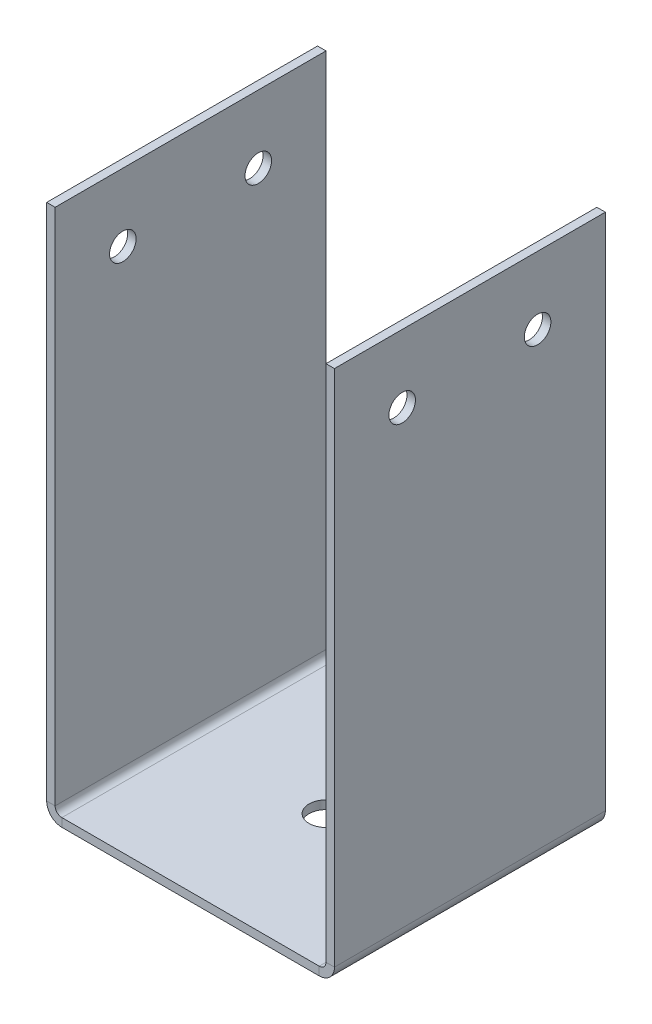
ISO-10303-21;
HEADER;
FILE_DESCRIPTION(('STEP AP214'),'2;1');
FILE_NAME('part.step','',(''),(''),'','','');
FILE_SCHEMA(('AUTOMOTIVE_DESIGN { 1 0 10303 214 1 1 1 1 }'));
ENDSEC;
DATA;
#1=APPLICATION_CONTEXT('core data for automotive mechanical design processes');
#2=APPLICATION_PROTOCOL_DEFINITION('international standard','automotive_design',2000,#1);
#3=PRODUCT_CONTEXT('',#1,'mechanical');
#4=PRODUCT('Part','Part','',(#3));
#5=PRODUCT_RELATED_PRODUCT_CATEGORY('part','',(#4));
#6=PRODUCT_DEFINITION_FORMATION('','',#4);
#7=PRODUCT_DEFINITION_CONTEXT('part definition',#1,'design');
#8=PRODUCT_DEFINITION('design','',#6,#7);
#9=PRODUCT_DEFINITION_SHAPE('','',#8);
#10=(LENGTH_UNIT() NAMED_UNIT(*) SI_UNIT(.MILLI.,.METRE.));
#11=(NAMED_UNIT(*) PLANE_ANGLE_UNIT() SI_UNIT($,.RADIAN.));
#12=(NAMED_UNIT(*) SI_UNIT($,.STERADIAN.) SOLID_ANGLE_UNIT());
#13=UNCERTAINTY_MEASURE_WITH_UNIT(LENGTH_MEASURE(1.E-05),#10,'distance_accuracy_value','');
#14=(GEOMETRIC_REPRESENTATION_CONTEXT(3) GLOBAL_UNCERTAINTY_ASSIGNED_CONTEXT((#13)) GLOBAL_UNIT_ASSIGNED_CONTEXT((#10,
#11,#12)) REPRESENTATION_CONTEXT('',''));
#15=CARTESIAN_POINT('',(0.,0.,0.));
#16=DIRECTION('',(0.,0.,1.));
#17=DIRECTION('',(1.,0.,0.));
#18=AXIS2_PLACEMENT_3D('',#15,#16,#17);
#19=CARTESIAN_POINT('',(0.,-1.5875,50.8));
#20=DIRECTION('',(0.,1.,0.));
#21=DIRECTION('',(0.,0.,1.));
#22=AXIS2_PLACEMENT_3D('',#19,#20,#21);
#23=PLANE('',#22);
#24=CARTESIAN_POINT('',(25.4,-1.58750000000001,25.4));
#25=DIRECTION('',(0.,1.,0.));
#26=DIRECTION('',(0.,0.,1.));
#27=AXIS2_PLACEMENT_3D('',#24,#25,#26);
#28=CIRCLE('',#27,3.175);
#29=CARTESIAN_POINT('',(25.4,-1.58750000000001,28.575));
#30=VERTEX_POINT('',#29);
#31=EDGE_CURVE('E366',#30,#30,#28,.T.);
#32=ORIENTED_EDGE('',*,*,#31,.T.);
#33=EDGE_LOOP('',(#32));
#34=FACE_BOUND('',#33,.T.);
#35=DIRECTION('',(0.,0.,-1.));
#36=VECTOR('',#35,1.);
#37=CARTESIAN_POINT('',(49.53,-1.5875,0.));
#38=LINE('',#37,#36);
#39=CARTESIAN_POINT('',(49.53,-1.5875,0.));
#40=VERTEX_POINT('',#39);
#41=CARTESIAN_POINT('',(49.53,-1.5875,50.8));
#42=VERTEX_POINT('',#41);
#43=EDGE_CURVE('E141',#40,#42,#38,.F.);
#44=ORIENTED_EDGE('',*,*,#43,.T.);
#45=DIRECTION('',(1.,0.,0.));
#46=VECTOR('',#45,1.);
#47=CARTESIAN_POINT('',(0.,-1.5875,50.8));
#48=LINE('',#47,#46);
#49=CARTESIAN_POINT('',(1.27,-1.5875,50.8));
#50=VERTEX_POINT('',#49);
#51=EDGE_CURVE('E51',#50,#42,#48,.T.);
#52=ORIENTED_EDGE('',*,*,#51,.F.);
#53=DIRECTION('',(0.,0.,1.));
#54=VECTOR('',#53,1.);
#55=CARTESIAN_POINT('',(1.27,-1.5875,50.8));
#56=LINE('',#55,#54);
#57=CARTESIAN_POINT('',(1.27,-1.5875,0.));
#58=VERTEX_POINT('',#57);
#59=EDGE_CURVE('E262',#50,#58,#56,.F.);
#60=ORIENTED_EDGE('',*,*,#59,.T.);
#61=DIRECTION('',(1.,0.,0.));
#62=VECTOR('',#61,1.);
#63=CARTESIAN_POINT('',(0.,-1.5875,0.));
#64=LINE('',#63,#62);
#65=EDGE_CURVE('E286',#58,#40,#64,.T.);
#66=ORIENTED_EDGE('',*,*,#65,.T.);
#67=EDGE_LOOP('',(#44,#52,#60,#66));
#68=FACE_BOUND('',#67,.T.);
#69=ADVANCED_FACE('F42',(#34,#68),#23,.F.);
#70=CARTESIAN_POINT('',(0.,0.,50.8));
#71=DIRECTION('',(0.,1.,0.));
#72=DIRECTION('',(0.,0.,1.));
#73=AXIS2_PLACEMENT_3D('',#70,#71,#72);
#74=PLANE('',#73);
#75=CARTESIAN_POINT('',(25.4,0.,25.4));
#76=DIRECTION('',(0.,1.,0.));
#77=DIRECTION('',(0.,0.,1.));
#78=AXIS2_PLACEMENT_3D('',#75,#76,#77);
#79=CIRCLE('',#78,3.175);
#80=CARTESIAN_POINT('',(25.4,0.,28.575));
#81=VERTEX_POINT('',#80);
#82=EDGE_CURVE('E45',#81,#81,#79,.T.);
#83=ORIENTED_EDGE('',*,*,#82,.F.);
#84=EDGE_LOOP('',(#83));
#85=FACE_BOUND('',#84,.T.);
#86=DIRECTION('',(1.,0.,0.));
#87=VECTOR('',#86,1.);
#88=CARTESIAN_POINT('',(0.,0.,50.8));
#89=LINE('',#88,#87);
#90=CARTESIAN_POINT('',(1.27,0.,50.8));
#91=VERTEX_POINT('',#90);
#92=CARTESIAN_POINT('',(49.53,0.,50.8));
#93=VERTEX_POINT('',#92);
#94=EDGE_CURVE('E11',#91,#93,#89,.T.);
#95=ORIENTED_EDGE('',*,*,#94,.T.);
#96=DIRECTION('',(0.,0.,-1.));
#97=VECTOR('',#96,1.);
#98=CARTESIAN_POINT('',(49.53,0.,0.));
#99=LINE('',#98,#97);
#100=CARTESIAN_POINT('',(49.53,0.,0.));
#101=VERTEX_POINT('',#100);
#102=EDGE_CURVE('E206',#101,#93,#99,.F.);
#103=ORIENTED_EDGE('',*,*,#102,.F.);
#104=DIRECTION('',(1.,0.,0.));
#105=VECTOR('',#104,1.);
#106=CARTESIAN_POINT('',(0.,0.,0.));
#107=LINE('',#106,#105);
#108=CARTESIAN_POINT('',(1.27,0.,0.));
#109=VERTEX_POINT('',#108);
#110=EDGE_CURVE('E292',#109,#101,#107,.T.);
#111=ORIENTED_EDGE('',*,*,#110,.F.);
#112=DIRECTION('',(0.,0.,1.));
#113=VECTOR('',#112,1.);
#114=CARTESIAN_POINT('',(1.27,0.,50.8));
#115=LINE('',#114,#113);
#116=EDGE_CURVE('E58',#91,#109,#115,.F.);
#117=ORIENTED_EDGE('',*,*,#116,.F.);
#118=EDGE_LOOP('',(#95,#103,#111,#117));
#119=FACE_BOUND('',#118,.T.);
#120=ADVANCED_FACE('F356',(#85,#119),#74,.T.);
#121=CARTESIAN_POINT('',(0.,0.,50.8));
#122=DIRECTION('',(0.,0.,-1.));
#123=DIRECTION('',(-1.,0.,0.));
#124=AXIS2_PLACEMENT_3D('',#121,#122,#123);
#125=PLANE('',#124);
#126=DIRECTION('',(0.,-1.,0.));
#127=VECTOR('',#126,1.);
#128=CARTESIAN_POINT('',(49.53,0.,50.8));
#129=LINE('',#128,#127);
#130=EDGE_CURVE('E212',#93,#42,#129,.T.);
#131=ORIENTED_EDGE('',*,*,#130,.F.);
#132=ORIENTED_EDGE('',*,*,#94,.F.);
#133=DIRECTION('',(0.,-1.,0.));
#134=VECTOR('',#133,1.);
#135=CARTESIAN_POINT('',(1.27,0.,50.8));
#136=LINE('',#135,#134);
#137=EDGE_CURVE('E271',#91,#50,#136,.T.);
#138=ORIENTED_EDGE('',*,*,#137,.T.);
#139=ORIENTED_EDGE('',*,*,#51,.T.);
#140=EDGE_LOOP('',(#131,#132,#138,#139));
#141=FACE_BOUND('',#140,.T.);
#142=ADVANCED_FACE('F361',(#141),#125,.F.);
#143=CARTESIAN_POINT('',(0.,0.,0.));
#144=DIRECTION('',(0.,0.,-1.));
#145=DIRECTION('',(-1.,0.,0.));
#146=AXIS2_PLACEMENT_3D('',#143,#144,#145);
#147=PLANE('',#146);
#148=ORIENTED_EDGE('',*,*,#110,.T.);
#149=DIRECTION('',(0.,-1.,0.));
#150=VECTOR('',#149,1.);
#151=CARTESIAN_POINT('',(49.53,0.,0.));
#152=LINE('',#151,#150);
#153=EDGE_CURVE('E201',#101,#40,#152,.T.);
#154=ORIENTED_EDGE('',*,*,#153,.T.);
#155=ORIENTED_EDGE('',*,*,#65,.F.);
#156=DIRECTION('',(0.,-1.,0.));
#157=VECTOR('',#156,1.);
#158=CARTESIAN_POINT('',(1.27,0.,0.));
#159=LINE('',#158,#157);
#160=EDGE_CURVE('E66',#109,#58,#159,.T.);
#161=ORIENTED_EDGE('',*,*,#160,.F.);
#162=EDGE_LOOP('',(#148,#154,#155,#161));
#163=FACE_BOUND('',#162,.T.);
#164=ADVANCED_FACE('F426',(#163),#147,.T.);
#165=CARTESIAN_POINT('',(1.27,1.27,0.));
#166=DIRECTION('',(0.,0.,-1.));
#167=DIRECTION('',(-1.,0.,0.));
#168=AXIS2_PLACEMENT_3D('',#165,#166,#167);
#169=PLANE('',#168);
#170=DIRECTION('',(-1.,0.,0.));
#171=VECTOR('',#170,1.);
#172=CARTESIAN_POINT('',(0.,1.27,0.));
#173=LINE('',#172,#171);
#174=CARTESIAN_POINT('',(0.,1.27,0.));
#175=VERTEX_POINT('',#174);
#176=CARTESIAN_POINT('',(-1.5875,1.26999999999999,0.));
#177=VERTEX_POINT('',#176);
#178=EDGE_CURVE('E216',#175,#177,#173,.T.);
#179=ORIENTED_EDGE('',*,*,#178,.F.);
#180=CARTESIAN_POINT('',(1.27,1.27,0.));
#181=DIRECTION('',(0.,0.,1.));
#182=DIRECTION('',(1.,0.,0.));
#183=AXIS2_PLACEMENT_3D('',#180,#181,#182);
#184=CIRCLE('',#183,1.27);
#185=EDGE_CURVE('E275',#109,#175,#184,.F.);
#186=ORIENTED_EDGE('',*,*,#185,.F.);
#187=ORIENTED_EDGE('',*,*,#160,.T.);
#188=CARTESIAN_POINT('',(1.27,1.27,0.));
#189=DIRECTION('',(0.,0.,1.));
#190=DIRECTION('',(1.,0.,0.));
#191=AXIS2_PLACEMENT_3D('',#188,#189,#190);
#192=CIRCLE('',#191,2.8575);
#193=EDGE_CURVE('E266',#58,#177,#192,.F.);
#194=ORIENTED_EDGE('',*,*,#193,.T.);
#195=EDGE_LOOP('',(#179,#186,#187,#194));
#196=FACE_BOUND('',#195,.T.);
#197=ADVANCED_FACE('F396',(#196),#169,.T.);
#198=CARTESIAN_POINT('',(1.27,1.27,50.8));
#199=DIRECTION('',(0.,0.,-1.));
#200=DIRECTION('',(-1.,0.,0.));
#201=AXIS2_PLACEMENT_3D('',#198,#199,#200);
#202=PLANE('',#201);
#203=CARTESIAN_POINT('',(1.27,1.27,50.8));
#204=DIRECTION('',(0.,0.,1.));
#205=DIRECTION('',(1.,0.,0.));
#206=AXIS2_PLACEMENT_3D('',#203,#204,#205);
#207=CIRCLE('',#206,1.27);
#208=CARTESIAN_POINT('',(0.,1.27,50.8));
#209=VERTEX_POINT('',#208);
#210=EDGE_CURVE('E261',#209,#91,#207,.T.);
#211=ORIENTED_EDGE('',*,*,#210,.F.);
#212=DIRECTION('',(-1.,0.,0.));
#213=VECTOR('',#212,1.);
#214=CARTESIAN_POINT('',(0.,1.27,50.8));
#215=LINE('',#214,#213);
#216=CARTESIAN_POINT('',(-1.5875,1.26999999999999,50.8));
#217=VERTEX_POINT('',#216);
#218=EDGE_CURVE('E223',#209,#217,#215,.T.);
#219=ORIENTED_EDGE('',*,*,#218,.T.);
#220=CARTESIAN_POINT('',(1.27,1.27,50.8));
#221=DIRECTION('',(0.,0.,1.));
#222=DIRECTION('',(1.,0.,0.));
#223=AXIS2_PLACEMENT_3D('',#220,#221,#222);
#224=CIRCLE('',#223,2.8575);
#225=EDGE_CURVE('E267',#217,#50,#224,.T.);
#226=ORIENTED_EDGE('',*,*,#225,.T.);
#227=ORIENTED_EDGE('',*,*,#137,.F.);
#228=EDGE_LOOP('',(#211,#219,#226,#227));
#229=FACE_BOUND('',#228,.T.);
#230=ADVANCED_FACE('F375',(#229),#202,.F.);
#231=CARTESIAN_POINT('',(1.27,1.27,50.8));
#232=DIRECTION('',(0.,0.,1.));
#233=DIRECTION('',(-1.,0.,0.));
#234=AXIS2_PLACEMENT_3D('',#231,#232,#233);
#235=CYLINDRICAL_SURFACE('',#234,2.8575);
#236=ORIENTED_EDGE('',*,*,#59,.F.);
#237=ORIENTED_EDGE('',*,*,#225,.F.);
#238=DIRECTION('',(0.,0.,-1.));
#239=VECTOR('',#238,1.);
#240=CARTESIAN_POINT('',(-1.5875,1.26999999999999,0.));
#241=LINE('',#240,#239);
#242=EDGE_CURVE('E227',#217,#177,#241,.T.);
#243=ORIENTED_EDGE('',*,*,#242,.T.);
#244=ORIENTED_EDGE('',*,*,#193,.F.);
#245=EDGE_LOOP('',(#236,#237,#243,#244));
#246=FACE_BOUND('',#245,.T.);
#247=ADVANCED_FACE('F374',(#246),#235,.T.);
#248=CARTESIAN_POINT('',(1.27,1.27,50.8));
#249=DIRECTION('',(0.,0.,1.));
#250=DIRECTION('',(-1.,0.,0.));
#251=AXIS2_PLACEMENT_3D('',#248,#249,#250);
#252=CYLINDRICAL_SURFACE('',#251,1.27);
#253=ORIENTED_EDGE('',*,*,#116,.T.);
#254=ORIENTED_EDGE('',*,*,#185,.T.);
#255=DIRECTION('',(0.,0.,1.));
#256=VECTOR('',#255,1.);
#257=CARTESIAN_POINT('',(0.,1.27,0.));
#258=LINE('',#257,#256);
#259=EDGE_CURVE('E220',#175,#209,#258,.T.);
#260=ORIENTED_EDGE('',*,*,#259,.T.);
#261=ORIENTED_EDGE('',*,*,#210,.T.);
#262=EDGE_LOOP('',(#253,#254,#260,#261));
#263=FACE_BOUND('',#262,.T.);
#264=ADVANCED_FACE('F399',(#263),#252,.F.);
#265=CARTESIAN_POINT('',(-1.58750000000034,98.4885,50.8));
#266=DIRECTION('',(0.,0.,-1.));
#267=DIRECTION('',(-1.,0.,0.));
#268=AXIS2_PLACEMENT_3D('',#265,#266,#267);
#269=PLANE('',#268);
#270=ORIENTED_EDGE('',*,*,#218,.F.);
#271=DIRECTION('',(0.,1.,0.));
#272=VECTOR('',#271,1.);
#273=CARTESIAN_POINT('',(-3.43870759840652E-13,98.4885,50.8));
#274=LINE('',#273,#272);
#275=CARTESIAN_POINT('',(-3.43870759840652E-13,98.4885,50.8));
#276=VERTEX_POINT('',#275);
#277=EDGE_CURVE('E233',#209,#276,#274,.T.);
#278=ORIENTED_EDGE('',*,*,#277,.T.);
#279=DIRECTION('',(1.,0.,0.));
#280=VECTOR('',#279,1.);
#281=CARTESIAN_POINT('',(-1.58750000000034,98.4885,50.8));
#282=LINE('',#281,#280);
#283=CARTESIAN_POINT('',(-1.58750000000034,98.4885,50.8));
#284=VERTEX_POINT('',#283);
#285=EDGE_CURVE('E257',#284,#276,#282,.T.);
#286=ORIENTED_EDGE('',*,*,#285,.F.);
#287=DIRECTION('',(0.,1.,0.));
#288=VECTOR('',#287,1.);
#289=CARTESIAN_POINT('',(-1.58750000000034,98.4885,50.8));
#290=LINE('',#289,#288);
#291=EDGE_CURVE('E234',#217,#284,#290,.T.);
#292=ORIENTED_EDGE('',*,*,#291,.F.);
#293=EDGE_LOOP('',(#270,#278,#286,#292));
#294=FACE_BOUND('',#293,.T.);
#295=ADVANCED_FACE('F385',(#294),#269,.F.);
#296=CARTESIAN_POINT('',(-1.5875,0.,0.));
#297=DIRECTION('',(0.,0.,1.));
#298=DIRECTION('',(1.,0.,0.));
#299=AXIS2_PLACEMENT_3D('',#296,#297,#298);
#300=PLANE('',#299);
#301=ORIENTED_EDGE('',*,*,#178,.T.);
#302=DIRECTION('',(0.,-1.,0.));
#303=VECTOR('',#302,1.);
#304=CARTESIAN_POINT('',(-1.5875,0.,0.));
#305=LINE('',#304,#303);
#306=CARTESIAN_POINT('',(-1.58750000000034,98.4885,0.));
#307=VERTEX_POINT('',#306);
#308=EDGE_CURVE('E241',#307,#177,#305,.T.);
#309=ORIENTED_EDGE('',*,*,#308,.F.);
#310=DIRECTION('',(1.,0.,0.));
#311=VECTOR('',#310,1.);
#312=CARTESIAN_POINT('',(-1.58750000000034,98.4885,0.));
#313=LINE('',#312,#311);
#314=CARTESIAN_POINT('',(-3.43870759840652E-13,98.4885,0.));
#315=VERTEX_POINT('',#314);
#316=EDGE_CURVE('E245',#307,#315,#313,.T.);
#317=ORIENTED_EDGE('',*,*,#316,.T.);
#318=DIRECTION('',(0.,-1.,0.));
#319=VECTOR('',#318,1.);
#320=CARTESIAN_POINT('',(0.,0.,0.));
#321=LINE('',#320,#319);
#322=EDGE_CURVE('E238',#315,#175,#321,.T.);
#323=ORIENTED_EDGE('',*,*,#322,.T.);
#324=EDGE_LOOP('',(#301,#309,#317,#323));
#325=FACE_BOUND('',#324,.T.);
#326=ADVANCED_FACE('F393',(#325),#300,.F.);
#327=CARTESIAN_POINT('',(-1.5875,0.,0.));
#328=DIRECTION('',(1.,0.,0.));
#329=DIRECTION('',(0.,1.,0.));
#330=AXIS2_PLACEMENT_3D('',#327,#328,#329);
#331=PLANE('',#330);
#332=CARTESIAN_POINT('',(-1.58750000000039,85.7885,38.1));
#333=DIRECTION('',(1.,0.,0.));
#334=DIRECTION('',(0.,1.,0.));
#335=AXIS2_PLACEMENT_3D('',#332,#333,#334);
#336=CIRCLE('',#335,2.4892);
#337=CARTESIAN_POINT('',(-1.58750000000038,88.2777,38.1));
#338=VERTEX_POINT('',#337);
#339=EDGE_CURVE('E302',#338,#338,#336,.T.);
#340=ORIENTED_EDGE('',*,*,#339,.T.);
#341=EDGE_LOOP('',(#340));
#342=FACE_BOUND('',#341,.T.);
#343=CARTESIAN_POINT('',(-1.58750000000039,85.7885,12.7));
#344=DIRECTION('',(1.,0.,0.));
#345=DIRECTION('',(0.,1.,0.));
#346=AXIS2_PLACEMENT_3D('',#343,#344,#345);
#347=CIRCLE('',#346,2.4892);
#348=CARTESIAN_POINT('',(-1.58750000000038,88.2777,12.7));
#349=VERTEX_POINT('',#348);
#350=EDGE_CURVE('E672',#349,#349,#347,.T.);
#351=ORIENTED_EDGE('',*,*,#350,.T.);
#352=EDGE_LOOP('',(#351));
#353=FACE_BOUND('',#352,.T.);
#354=ORIENTED_EDGE('',*,*,#242,.F.);
#355=ORIENTED_EDGE('',*,*,#291,.T.);
#356=DIRECTION('',(0.,0.,-1.));
#357=VECTOR('',#356,1.);
#358=CARTESIAN_POINT('',(-1.58750000000034,98.4885,0.));
#359=LINE('',#358,#357);
#360=EDGE_CURVE('E237',#284,#307,#359,.T.);
#361=ORIENTED_EDGE('',*,*,#360,.T.);
#362=ORIENTED_EDGE('',*,*,#308,.T.);
#363=EDGE_LOOP('',(#354,#355,#361,#362));
#364=FACE_BOUND('',#363,.T.);
#365=ADVANCED_FACE('F382',(#342,#353,#364),#331,.F.);
#366=CARTESIAN_POINT('',(0.,0.,0.));
#367=DIRECTION('',(1.,0.,0.));
#368=DIRECTION('',(0.,1.,0.));
#369=AXIS2_PLACEMENT_3D('',#366,#367,#368);
#370=PLANE('',#369);
#371=CARTESIAN_POINT('',(-2.99456640040496E-13,85.7885,38.1));
#372=DIRECTION('',(1.,0.,0.));
#373=DIRECTION('',(0.,1.,0.));
#374=AXIS2_PLACEMENT_3D('',#371,#372,#373);
#375=CIRCLE('',#374,2.4892);
#376=CARTESIAN_POINT('',(-3.08147635389145E-13,88.2777,38.1));
#377=VERTEX_POINT('',#376);
#378=EDGE_CURVE('E306',#377,#377,#375,.T.);
#379=ORIENTED_EDGE('',*,*,#378,.F.);
#380=EDGE_LOOP('',(#379));
#381=FACE_BOUND('',#380,.T.);
#382=CARTESIAN_POINT('',(-2.99456640040496E-13,85.7885,12.7));
#383=DIRECTION('',(1.,0.,0.));
#384=DIRECTION('',(0.,1.,0.));
#385=AXIS2_PLACEMENT_3D('',#382,#383,#384);
#386=CIRCLE('',#385,2.4892);
#387=CARTESIAN_POINT('',(-3.08147635389145E-13,88.2777,12.7));
#388=VERTEX_POINT('',#387);
#389=EDGE_CURVE('E301',#388,#388,#386,.T.);
#390=ORIENTED_EDGE('',*,*,#389,.F.);
#391=EDGE_LOOP('',(#390));
#392=FACE_BOUND('',#391,.T.);
#393=ORIENTED_EDGE('',*,*,#277,.F.);
#394=ORIENTED_EDGE('',*,*,#259,.F.);
#395=ORIENTED_EDGE('',*,*,#322,.F.);
#396=DIRECTION('',(0.,0.,-1.));
#397=VECTOR('',#396,1.);
#398=CARTESIAN_POINT('',(-3.43870759840652E-13,98.4885,0.));
#399=LINE('',#398,#397);
#400=EDGE_CURVE('E248',#276,#315,#399,.T.);
#401=ORIENTED_EDGE('',*,*,#400,.F.);
#402=EDGE_LOOP('',(#393,#394,#395,#401));
#403=FACE_BOUND('',#402,.T.);
#404=ADVANCED_FACE('F401',(#381,#392,#403),#370,.T.);
#405=CARTESIAN_POINT('',(-1.58750000000034,98.4885,0.));
#406=DIRECTION('',(0.,-1.,0.));
#407=DIRECTION('',(1.,0.,0.));
#408=AXIS2_PLACEMENT_3D('',#405,#406,#407);
#409=PLANE('',#408);
#410=ORIENTED_EDGE('',*,*,#400,.T.);
#411=ORIENTED_EDGE('',*,*,#316,.F.);
#412=ORIENTED_EDGE('',*,*,#360,.F.);
#413=ORIENTED_EDGE('',*,*,#285,.T.);
#414=EDGE_LOOP('',(#410,#411,#412,#413));
#415=FACE_BOUND('',#414,.T.);
#416=ADVANCED_FACE('F390',(#415),#409,.F.);
#417=CARTESIAN_POINT('',(49.53,1.27,50.8));
#418=DIRECTION('',(0.,0.,1.));
#419=DIRECTION('',(1.,0.,0.));
#420=AXIS2_PLACEMENT_3D('',#417,#418,#419);
#421=PLANE('',#420);
#422=DIRECTION('',(1.,0.,0.));
#423=VECTOR('',#422,1.);
#424=CARTESIAN_POINT('',(50.8,1.26999999999999,50.8));
#425=LINE('',#424,#423);
#426=CARTESIAN_POINT('',(50.8,1.26999999999999,50.8));
#427=VERTEX_POINT('',#426);
#428=CARTESIAN_POINT('',(52.3875,1.26999999999999,50.8));
#429=VERTEX_POINT('',#428);
#430=EDGE_CURVE('E312',#427,#429,#425,.T.);
#431=ORIENTED_EDGE('',*,*,#430,.F.);
#432=CARTESIAN_POINT('',(49.53,1.27,50.8));
#433=DIRECTION('',(0.,0.,-1.));
#434=DIRECTION('',(-1.,0.,0.));
#435=AXIS2_PLACEMENT_3D('',#432,#433,#434);
#436=CIRCLE('',#435,1.27);
#437=EDGE_CURVE('E145',#93,#427,#436,.F.);
#438=ORIENTED_EDGE('',*,*,#437,.F.);
#439=ORIENTED_EDGE('',*,*,#130,.T.);
#440=CARTESIAN_POINT('',(49.53,1.27,50.8));
#441=DIRECTION('',(0.,0.,-1.));
#442=DIRECTION('',(-1.,0.,0.));
#443=AXIS2_PLACEMENT_3D('',#440,#441,#442);
#444=CIRCLE('',#443,2.8575);
#445=EDGE_CURVE('E199',#42,#429,#444,.F.);
#446=ORIENTED_EDGE('',*,*,#445,.T.);
#447=EDGE_LOOP('',(#431,#438,#439,#446));
#448=FACE_BOUND('',#447,.T.);
#449=ADVANCED_FACE('F330',(#448),#421,.T.);
#450=CARTESIAN_POINT('',(49.53,1.27,0.));
#451=DIRECTION('',(0.,0.,1.));
#452=DIRECTION('',(1.,0.,0.));
#453=AXIS2_PLACEMENT_3D('',#450,#451,#452);
#454=PLANE('',#453);
#455=CARTESIAN_POINT('',(49.53,1.27,0.));
#456=DIRECTION('',(0.,0.,-1.));
#457=DIRECTION('',(-1.,0.,0.));
#458=AXIS2_PLACEMENT_3D('',#455,#456,#457);
#459=CIRCLE('',#458,1.27);
#460=CARTESIAN_POINT('',(50.8,1.26999999999999,0.));
#461=VERTEX_POINT('',#460);
#462=EDGE_CURVE('E152',#461,#101,#459,.T.);
#463=ORIENTED_EDGE('',*,*,#462,.F.);
#464=DIRECTION('',(1.,0.,0.));
#465=VECTOR('',#464,1.);
#466=CARTESIAN_POINT('',(50.8,1.26999999999999,0.));
#467=LINE('',#466,#465);
#468=CARTESIAN_POINT('',(52.3875,1.26999999999999,0.));
#469=VERTEX_POINT('',#468);
#470=EDGE_CURVE('E149',#461,#469,#467,.T.);
#471=ORIENTED_EDGE('',*,*,#470,.T.);
#472=CARTESIAN_POINT('',(49.53,1.27,0.));
#473=DIRECTION('',(0.,0.,-1.));
#474=DIRECTION('',(-1.,0.,0.));
#475=AXIS2_PLACEMENT_3D('',#472,#473,#474);
#476=CIRCLE('',#475,2.8575);
#477=EDGE_CURVE('E134',#469,#40,#476,.T.);
#478=ORIENTED_EDGE('',*,*,#477,.T.);
#479=ORIENTED_EDGE('',*,*,#153,.F.);
#480=EDGE_LOOP('',(#463,#471,#478,#479));
#481=FACE_BOUND('',#480,.T.);
#482=ADVANCED_FACE('F150',(#481),#454,.F.);
#483=CARTESIAN_POINT('',(49.53,1.27,0.));
#484=DIRECTION('',(0.,0.,-1.));
#485=DIRECTION('',(1.,0.,0.));
#486=AXIS2_PLACEMENT_3D('',#483,#484,#485);
#487=CYLINDRICAL_SURFACE('',#486,2.8575);
#488=ORIENTED_EDGE('',*,*,#43,.F.);
#489=ORIENTED_EDGE('',*,*,#477,.F.);
#490=DIRECTION('',(0.,0.,1.));
#491=VECTOR('',#490,1.);
#492=CARTESIAN_POINT('',(52.3875,1.26999999999999,0.));
#493=LINE('',#492,#491);
#494=EDGE_CURVE('E139',#469,#429,#493,.T.);
#495=ORIENTED_EDGE('',*,*,#494,.T.);
#496=ORIENTED_EDGE('',*,*,#445,.F.);
#497=EDGE_LOOP('',(#488,#489,#495,#496));
#498=FACE_BOUND('',#497,.T.);
#499=ADVANCED_FACE('F136',(#498),#487,.T.);
#500=CARTESIAN_POINT('',(49.53,1.27,0.));
#501=DIRECTION('',(0.,0.,-1.));
#502=DIRECTION('',(1.,0.,0.));
#503=AXIS2_PLACEMENT_3D('',#500,#501,#502);
#504=CYLINDRICAL_SURFACE('',#503,1.27);
#505=ORIENTED_EDGE('',*,*,#102,.T.);
#506=ORIENTED_EDGE('',*,*,#437,.T.);
#507=DIRECTION('',(0.,0.,-1.));
#508=VECTOR('',#507,1.);
#509=CARTESIAN_POINT('',(50.8,1.26999999999999,50.8));
#510=LINE('',#509,#508);
#511=EDGE_CURVE('E157',#427,#461,#510,.T.);
#512=ORIENTED_EDGE('',*,*,#511,.T.);
#513=ORIENTED_EDGE('',*,*,#462,.T.);
#514=EDGE_LOOP('',(#505,#506,#512,#513));
#515=FACE_BOUND('',#514,.T.);
#516=ADVANCED_FACE('F333',(#515),#504,.F.);
#517=CARTESIAN_POINT('',(52.3875000000003,98.4884999999998,0.));
#518=DIRECTION('',(0.,0.,1.));
#519=DIRECTION('',(1.,0.,0.));
#520=AXIS2_PLACEMENT_3D('',#517,#518,#519);
#521=PLANE('',#520);
#522=ORIENTED_EDGE('',*,*,#470,.F.);
#523=DIRECTION('',(0.,1.,0.));
#524=VECTOR('',#523,1.);
#525=CARTESIAN_POINT('',(50.8000000000003,98.4884999999998,0.));
#526=LINE('',#525,#524);
#527=CARTESIAN_POINT('',(50.8000000000003,98.4884999999998,0.));
#528=VERTEX_POINT('',#527);
#529=EDGE_CURVE('E167',#461,#528,#526,.T.);
#530=ORIENTED_EDGE('',*,*,#529,.T.);
#531=DIRECTION('',(-1.,0.,0.));
#532=VECTOR('',#531,1.);
#533=CARTESIAN_POINT('',(52.3875000000003,98.4884999999998,0.));
#534=LINE('',#533,#532);
#535=CARTESIAN_POINT('',(52.3875000000003,98.4884999999998,0.));
#536=VERTEX_POINT('',#535);
#537=EDGE_CURVE('E171',#536,#528,#534,.T.);
#538=ORIENTED_EDGE('',*,*,#537,.F.);
#539=DIRECTION('',(0.,1.,0.));
#540=VECTOR('',#539,1.);
#541=CARTESIAN_POINT('',(52.3875000000003,98.4884999999998,0.));
#542=LINE('',#541,#540);
#543=EDGE_CURVE('E162',#469,#536,#542,.T.);
#544=ORIENTED_EDGE('',*,*,#543,.F.);
#545=EDGE_LOOP('',(#522,#530,#538,#544));
#546=FACE_BOUND('',#545,.T.);
#547=ADVANCED_FACE('F169',(#546),#521,.F.);
#548=CARTESIAN_POINT('',(52.3875,0.,50.8));
#549=DIRECTION('',(0.,0.,-1.));
#550=DIRECTION('',(-1.,0.,0.));
#551=AXIS2_PLACEMENT_3D('',#548,#549,#550);
#552=PLANE('',#551);
#553=ORIENTED_EDGE('',*,*,#430,.T.);
#554=DIRECTION('',(0.,-1.,0.));
#555=VECTOR('',#554,1.);
#556=CARTESIAN_POINT('',(52.3875,0.,50.8));
#557=LINE('',#556,#555);
#558=CARTESIAN_POINT('',(52.3875000000003,98.4884999999998,50.8));
#559=VERTEX_POINT('',#558);
#560=EDGE_CURVE('E165',#559,#429,#557,.T.);
#561=ORIENTED_EDGE('',*,*,#560,.F.);
#562=DIRECTION('',(-1.,0.,0.));
#563=VECTOR('',#562,1.);
#564=CARTESIAN_POINT('',(52.3875000000003,98.4884999999998,50.8));
#565=LINE('',#564,#563);
#566=CARTESIAN_POINT('',(50.8000000000003,98.4884999999998,50.8));
#567=VERTEX_POINT('',#566);
#568=EDGE_CURVE('E187',#559,#567,#565,.T.);
#569=ORIENTED_EDGE('',*,*,#568,.T.);
#570=DIRECTION('',(0.,-1.,0.));
#571=VECTOR('',#570,1.);
#572=CARTESIAN_POINT('',(50.8,0.,50.8));
#573=LINE('',#572,#571);
#574=EDGE_CURVE('E175',#567,#427,#573,.T.);
#575=ORIENTED_EDGE('',*,*,#574,.T.);
#576=EDGE_LOOP('',(#553,#561,#569,#575));
#577=FACE_BOUND('',#576,.T.);
#578=ADVANCED_FACE('F326',(#577),#552,.F.);
#579=CARTESIAN_POINT('',(52.3875,-1.84495502999552E-13,0.));
#580=DIRECTION('',(-1.,0.,0.));
#581=DIRECTION('',(0.,-1.,0.));
#582=AXIS2_PLACEMENT_3D('',#579,#580,#581);
#583=PLANE('',#582);
#584=CARTESIAN_POINT('',(52.3875000000003,85.7884999999998,38.1));
#585=DIRECTION('',(1.,0.,0.));
#586=DIRECTION('',(0.,1.,0.));
#587=AXIS2_PLACEMENT_3D('',#584,#585,#586);
#588=CIRCLE('',#587,2.4892);
#589=CARTESIAN_POINT('',(52.3875000000003,88.2776999999998,38.1));
#590=VERTEX_POINT('',#589);
#591=EDGE_CURVE('E677',#590,#590,#588,.T.);
#592=ORIENTED_EDGE('',*,*,#591,.F.);
#593=EDGE_LOOP('',(#592));
#594=FACE_BOUND('',#593,.T.);
#595=CARTESIAN_POINT('',(52.3875000000003,85.7884999999998,12.7));
#596=DIRECTION('',(1.,0.,0.));
#597=DIRECTION('',(0.,1.,0.));
#598=AXIS2_PLACEMENT_3D('',#595,#596,#597);
#599=CIRCLE('',#598,2.4892);
#600=CARTESIAN_POINT('',(52.3875000000003,88.2776999999998,12.7));
#601=VERTEX_POINT('',#600);
#602=EDGE_CURVE('E319',#601,#601,#599,.T.);
#603=ORIENTED_EDGE('',*,*,#602,.F.);
#604=EDGE_LOOP('',(#603));
#605=FACE_BOUND('',#604,.T.);
#606=ORIENTED_EDGE('',*,*,#494,.F.);
#607=ORIENTED_EDGE('',*,*,#543,.T.);
#608=DIRECTION('',(0.,0.,1.));
#609=VECTOR('',#608,1.);
#610=CARTESIAN_POINT('',(52.3875000000003,98.4884999999998,50.8));
#611=LINE('',#610,#609);
#612=EDGE_CURVE('E174',#536,#559,#611,.T.);
#613=ORIENTED_EDGE('',*,*,#612,.T.);
#614=ORIENTED_EDGE('',*,*,#560,.T.);
#615=EDGE_LOOP('',(#606,#607,#613,#614));
#616=FACE_BOUND('',#615,.T.);
#617=ADVANCED_FACE('F161',(#594,#605,#616),#583,.F.);
#618=CARTESIAN_POINT('',(50.8,-1.78952776374139E-13,0.));
#619=DIRECTION('',(-1.,0.,0.));
#620=DIRECTION('',(0.,-1.,0.));
#621=AXIS2_PLACEMENT_3D('',#618,#619,#620);
#622=PLANE('',#621);
#623=CARTESIAN_POINT('',(50.8000000000003,85.7884999999998,38.1));
#624=DIRECTION('',(-1.,0.,0.));
#625=DIRECTION('',(0.,-1.,0.));
#626=AXIS2_PLACEMENT_3D('',#623,#624,#625);
#627=CIRCLE('',#626,2.4892);
#628=CARTESIAN_POINT('',(50.8000000000003,83.2992999999998,38.1));
#629=VERTEX_POINT('',#628);
#630=EDGE_CURVE('E303',#629,#629,#627,.T.);
#631=ORIENTED_EDGE('',*,*,#630,.F.);
#632=EDGE_LOOP('',(#631));
#633=FACE_BOUND('',#632,.T.);
#634=CARTESIAN_POINT('',(50.8000000000003,85.7884999999998,12.7));
#635=DIRECTION('',(-1.,0.,0.));
#636=DIRECTION('',(0.,-1.,0.));
#637=AXIS2_PLACEMENT_3D('',#634,#635,#636);
#638=CIRCLE('',#637,2.4892);
#639=CARTESIAN_POINT('',(50.8000000000003,83.2992999999998,12.7));
#640=VERTEX_POINT('',#639);
#641=EDGE_CURVE('E298',#640,#640,#638,.T.);
#642=ORIENTED_EDGE('',*,*,#641,.F.);
#643=EDGE_LOOP('',(#642));
#644=FACE_BOUND('',#643,.T.);
#645=ORIENTED_EDGE('',*,*,#529,.F.);
#646=ORIENTED_EDGE('',*,*,#511,.F.);
#647=ORIENTED_EDGE('',*,*,#574,.F.);
#648=DIRECTION('',(0.,0.,1.));
#649=VECTOR('',#648,1.);
#650=CARTESIAN_POINT('',(50.8000000000003,98.4884999999998,50.8));
#651=LINE('',#650,#649);
#652=EDGE_CURVE('E181',#528,#567,#651,.T.);
#653=ORIENTED_EDGE('',*,*,#652,.F.);
#654=EDGE_LOOP('',(#645,#646,#647,#653));
#655=FACE_BOUND('',#654,.T.);
#656=ADVANCED_FACE('F335',(#633,#644,#655),#622,.T.);
#657=CARTESIAN_POINT('',(52.3875000000003,98.4884999999998,50.8));
#658=DIRECTION('',(0.,-1.,0.));
#659=DIRECTION('',(1.,0.,0.));
#660=AXIS2_PLACEMENT_3D('',#657,#658,#659);
#661=PLANE('',#660);
#662=ORIENTED_EDGE('',*,*,#652,.T.);
#663=ORIENTED_EDGE('',*,*,#568,.F.);
#664=ORIENTED_EDGE('',*,*,#612,.F.);
#665=ORIENTED_EDGE('',*,*,#537,.T.);
#666=EDGE_LOOP('',(#662,#663,#664,#665));
#667=FACE_BOUND('',#666,.T.);
#668=ADVANCED_FACE('F338',(#667),#661,.F.);
#669=CARTESIAN_POINT('',(-1.58750000000039,85.7885,12.7));
#670=DIRECTION('',(1.,0.,0.));
#671=DIRECTION('',(0.,1.,0.));
#672=AXIS2_PLACEMENT_3D('',#669,#670,#671);
#673=CYLINDRICAL_SURFACE('',#672,2.4892);
#674=ORIENTED_EDGE('',*,*,#641,.T.);
#675=EDGE_LOOP('',(#674));
#676=FACE_BOUND('',#675,.T.);
#677=ORIENTED_EDGE('',*,*,#602,.T.);
#678=EDGE_LOOP('',(#677));
#679=FACE_BOUND('',#678,.T.);
#680=ADVANCED_FACE('F341',(#676,#679),#673,.F.);
#681=CARTESIAN_POINT('',(-1.58750000000039,85.7885,38.1));
#682=DIRECTION('',(1.,0.,0.));
#683=DIRECTION('',(0.,1.,0.));
#684=AXIS2_PLACEMENT_3D('',#681,#682,#683);
#685=CYLINDRICAL_SURFACE('',#684,2.4892);
#686=ORIENTED_EDGE('',*,*,#630,.T.);
#687=EDGE_LOOP('',(#686));
#688=FACE_BOUND('',#687,.T.);
#689=ORIENTED_EDGE('',*,*,#591,.T.);
#690=EDGE_LOOP('',(#689));
#691=FACE_BOUND('',#690,.T.);
#692=ADVANCED_FACE('F347',(#688,#691),#685,.F.);
#693=ORIENTED_EDGE('',*,*,#389,.T.);
#694=EDGE_LOOP('',(#693));
#695=FACE_BOUND('',#694,.T.);
#696=ORIENTED_EDGE('',*,*,#350,.F.);
#697=EDGE_LOOP('',(#696));
#698=FACE_BOUND('',#697,.T.);
#699=ADVANCED_FACE('F350',(#695,#698),#673,.F.);
#700=ORIENTED_EDGE('',*,*,#378,.T.);
#701=EDGE_LOOP('',(#700));
#702=FACE_BOUND('',#701,.T.);
#703=ORIENTED_EDGE('',*,*,#339,.F.);
#704=EDGE_LOOP('',(#703));
#705=FACE_BOUND('',#704,.T.);
#706=ADVANCED_FACE('F512',(#702,#705),#685,.F.);
#707=CARTESIAN_POINT('',(25.4,98.4885,25.4));
#708=DIRECTION('',(0.,-1.,0.));
#709=DIRECTION('',(0.,0.,-1.));
#710=AXIS2_PLACEMENT_3D('',#707,#708,#709);
#711=CYLINDRICAL_SURFACE('',#710,3.175);
#712=ORIENTED_EDGE('',*,*,#82,.T.);
#713=EDGE_LOOP('',(#712));
#714=FACE_BOUND('',#713,.T.);
#715=ORIENTED_EDGE('',*,*,#31,.F.);
#716=EDGE_LOOP('',(#715));
#717=FACE_BOUND('',#716,.T.);
#718=ADVANCED_FACE('F528',(#714,#717),#711,.F.);
#719=CLOSED_SHELL('',(#69,#120,#142,#164,#197,#230,#247,#264,#295,#326,#365,#404,#416,#449,#482,
#499,#516,#547,#578,#617,#656,#668,#680,#692,#699,#706,#718));
#720=MANIFOLD_SOLID_BREP('B2',#719);
#721=ADVANCED_BREP_SHAPE_REPRESENTATION('',(#18,#720),#14);
#722=SHAPE_DEFINITION_REPRESENTATION(#9,#721);
ENDSEC;
END-ISO-10303-21;
